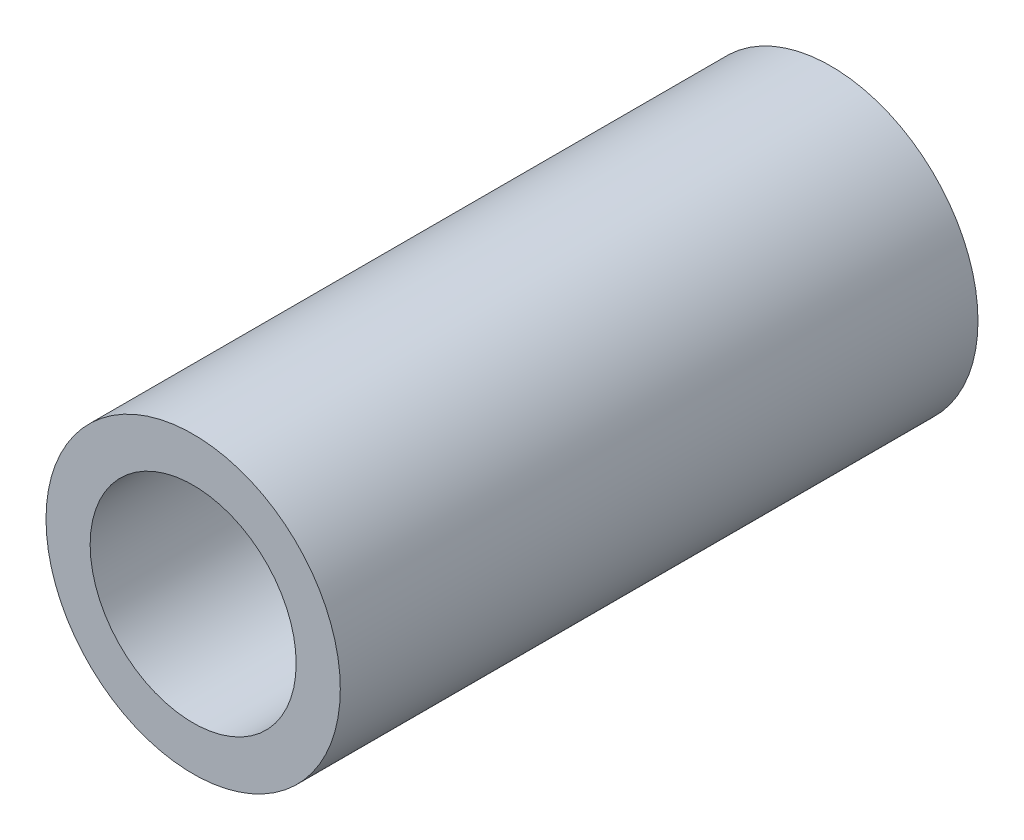
ISO-10303-21;
HEADER;
FILE_DESCRIPTION(('STEP AP214'),'2;1');
FILE_NAME('part.step','',(''),(''),'','','');
FILE_SCHEMA(('AUTOMOTIVE_DESIGN { 1 0 10303 214 1 1 1 1 }'));
ENDSEC;
DATA;
#1=APPLICATION_CONTEXT('core data for automotive mechanical design processes');
#2=APPLICATION_PROTOCOL_DEFINITION('international standard','automotive_design',2000,#1);
#3=PRODUCT_CONTEXT('',#1,'mechanical');
#4=PRODUCT('Part','Part','',(#3));
#5=PRODUCT_RELATED_PRODUCT_CATEGORY('part','',(#4));
#6=PRODUCT_DEFINITION_FORMATION('','',#4);
#7=PRODUCT_DEFINITION_CONTEXT('part definition',#1,'design');
#8=PRODUCT_DEFINITION('design','',#6,#7);
#9=PRODUCT_DEFINITION_SHAPE('','',#8);
#10=(LENGTH_UNIT() NAMED_UNIT(*) SI_UNIT(.MILLI.,.METRE.));
#11=(NAMED_UNIT(*) PLANE_ANGLE_UNIT() SI_UNIT($,.RADIAN.));
#12=(NAMED_UNIT(*) SI_UNIT($,.STERADIAN.) SOLID_ANGLE_UNIT());
#13=UNCERTAINTY_MEASURE_WITH_UNIT(LENGTH_MEASURE(1.E-05),#10,'distance_accuracy_value','');
#14=(GEOMETRIC_REPRESENTATION_CONTEXT(3) GLOBAL_UNCERTAINTY_ASSIGNED_CONTEXT((#13)) GLOBAL_UNIT_ASSIGNED_CONTEXT((#10,
#11,#12)) REPRESENTATION_CONTEXT('',''));
#15=CARTESIAN_POINT('',(0.,0.,0.));
#16=DIRECTION('',(0.,0.,1.));
#17=DIRECTION('',(1.,0.,0.));
#18=AXIS2_PLACEMENT_3D('',#15,#16,#17);
#19=CARTESIAN_POINT('',(0.,0.,13.));
#20=DIRECTION('',(0.,0.,1.));
#21=DIRECTION('',(1.,0.,0.));
#22=AXIS2_PLACEMENT_3D('',#19,#20,#21);
#23=PLANE('',#22);
#24=CARTESIAN_POINT('',(0.,0.,13.));
#25=DIRECTION('',(0.,0.,1.));
#26=DIRECTION('',(1.,0.,0.));
#27=AXIS2_PLACEMENT_3D('',#24,#25,#26);
#28=CIRCLE('',#27,3.);
#29=CARTESIAN_POINT('',(3.,0.,13.));
#30=VERTEX_POINT('',#29);
#31=EDGE_CURVE('E10',#30,#30,#28,.T.);
#32=ORIENTED_EDGE('',*,*,#31,.T.);
#33=EDGE_LOOP('',(#32));
#34=FACE_BOUND('',#33,.T.);
#35=CARTESIAN_POINT('',(0.,0.,13.));
#36=DIRECTION('',(0.,0.,1.));
#37=DIRECTION('',(1.,0.,0.));
#38=AXIS2_PLACEMENT_3D('',#35,#36,#37);
#39=CIRCLE('',#38,2.1);
#40=CARTESIAN_POINT('',(2.1,0.,13.));
#41=VERTEX_POINT('',#40);
#42=EDGE_CURVE('E42',#41,#41,#39,.T.);
#43=ORIENTED_EDGE('',*,*,#42,.F.);
#44=EDGE_LOOP('',(#43));
#45=FACE_BOUND('',#44,.T.);
#46=ADVANCED_FACE('F31',(#34,#45),#23,.T.);
#47=CARTESIAN_POINT('',(0.,0.,0.));
#48=DIRECTION('',(0.,0.,1.));
#49=DIRECTION('',(1.,0.,0.));
#50=AXIS2_PLACEMENT_3D('',#47,#48,#49);
#51=PLANE('',#50);
#52=CARTESIAN_POINT('',(0.,0.,0.));
#53=DIRECTION('',(0.,0.,1.));
#54=DIRECTION('',(1.,0.,0.));
#55=AXIS2_PLACEMENT_3D('',#52,#53,#54);
#56=CIRCLE('',#55,3.);
#57=CARTESIAN_POINT('',(3.,0.,0.));
#58=VERTEX_POINT('',#57);
#59=EDGE_CURVE('E35',#58,#58,#56,.T.);
#60=ORIENTED_EDGE('',*,*,#59,.F.);
#61=EDGE_LOOP('',(#60));
#62=FACE_BOUND('',#61,.T.);
#63=CARTESIAN_POINT('',(0.,0.,0.));
#64=DIRECTION('',(0.,0.,1.));
#65=DIRECTION('',(1.,0.,0.));
#66=AXIS2_PLACEMENT_3D('',#63,#64,#65);
#67=CIRCLE('',#66,2.1);
#68=CARTESIAN_POINT('',(2.1,0.,0.));
#69=VERTEX_POINT('',#68);
#70=EDGE_CURVE('E44',#69,#69,#67,.T.);
#71=ORIENTED_EDGE('',*,*,#70,.T.);
#72=EDGE_LOOP('',(#71));
#73=FACE_BOUND('',#72,.T.);
#74=ADVANCED_FACE('F54',(#62,#73),#51,.F.);
#75=CARTESIAN_POINT('',(0.,0.,13.));
#76=DIRECTION('',(0.,0.,-1.));
#77=DIRECTION('',(-1.,0.,0.));
#78=AXIS2_PLACEMENT_3D('',#75,#76,#77);
#79=CYLINDRICAL_SURFACE('',#78,3.);
#80=ORIENTED_EDGE('',*,*,#31,.F.);
#81=EDGE_LOOP('',(#80));
#82=FACE_BOUND('',#81,.T.);
#83=ORIENTED_EDGE('',*,*,#59,.T.);
#84=EDGE_LOOP('',(#83));
#85=FACE_BOUND('',#84,.T.);
#86=ADVANCED_FACE('F33',(#82,#85),#79,.T.);
#87=CARTESIAN_POINT('',(0.,0.,13.));
#88=DIRECTION('',(0.,0.,-1.));
#89=DIRECTION('',(-1.,0.,0.));
#90=AXIS2_PLACEMENT_3D('',#87,#88,#89);
#91=CYLINDRICAL_SURFACE('',#90,2.1);
#92=ORIENTED_EDGE('',*,*,#42,.T.);
#93=EDGE_LOOP('',(#92));
#94=FACE_BOUND('',#93,.T.);
#95=ORIENTED_EDGE('',*,*,#70,.F.);
#96=EDGE_LOOP('',(#95));
#97=FACE_BOUND('',#96,.T.);
#98=ADVANCED_FACE('F50',(#94,#97),#91,.F.);
#99=CLOSED_SHELL('',(#46,#74,#86,#98));
#100=MANIFOLD_SOLID_BREP('B2',#99);
#101=ADVANCED_BREP_SHAPE_REPRESENTATION('',(#18,#100),#14);
#102=SHAPE_DEFINITION_REPRESENTATION(#9,#101);
ENDSEC;
END-ISO-10303-21;
